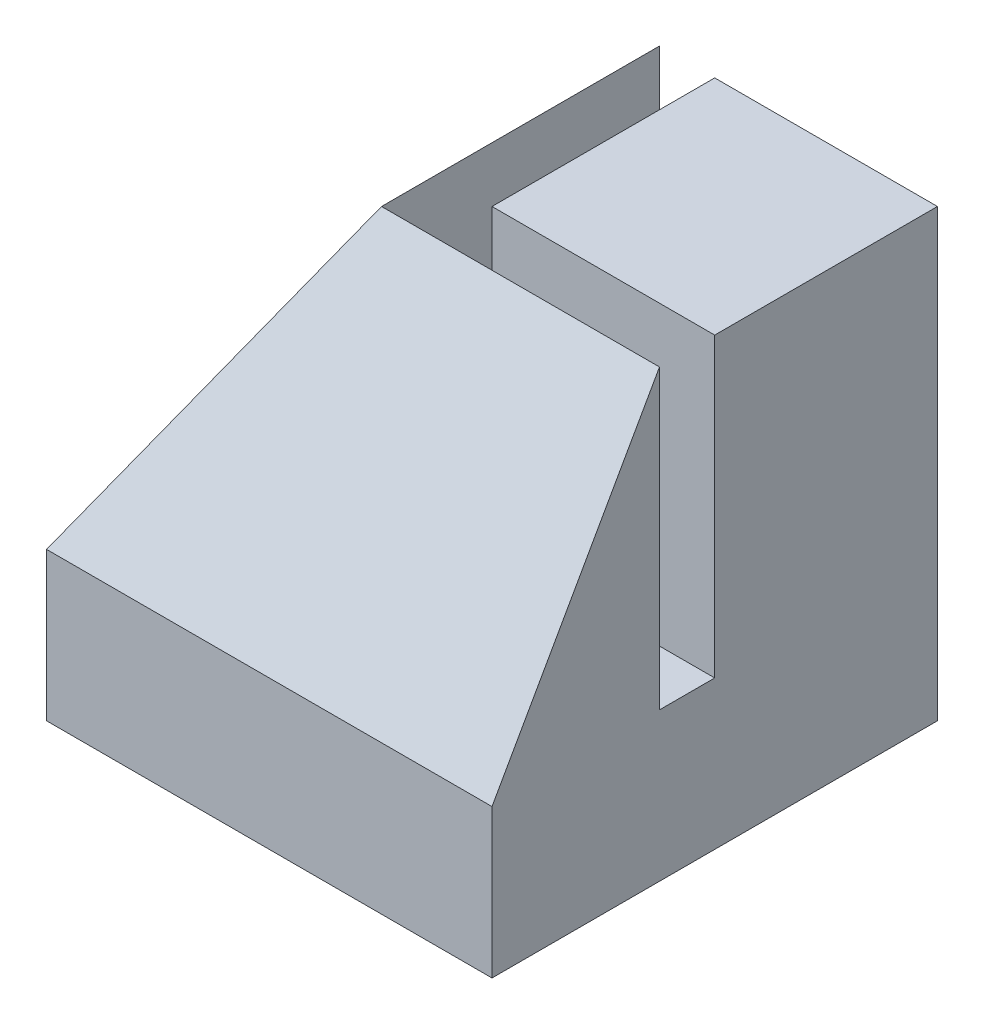
ISO-10303-21;
HEADER;
FILE_DESCRIPTION(('STEP AP214'),'2;1');
FILE_NAME('part.step','',(''),(''),'','','');
FILE_SCHEMA(('AUTOMOTIVE_DESIGN { 1 0 10303 214 1 1 1 1 }'));
ENDSEC;
DATA;
#1=APPLICATION_CONTEXT('core data for automotive mechanical design processes');
#2=APPLICATION_PROTOCOL_DEFINITION('international standard','automotive_design',2000,#1);
#3=PRODUCT_CONTEXT('',#1,'mechanical');
#4=PRODUCT('Part','Part','',(#3));
#5=PRODUCT_RELATED_PRODUCT_CATEGORY('part','',(#4));
#6=PRODUCT_DEFINITION_FORMATION('','',#4);
#7=PRODUCT_DEFINITION_CONTEXT('part definition',#1,'design');
#8=PRODUCT_DEFINITION('design','',#6,#7);
#9=PRODUCT_DEFINITION_SHAPE('','',#8);
#10=(LENGTH_UNIT() NAMED_UNIT(*) SI_UNIT(.MILLI.,.METRE.));
#11=(NAMED_UNIT(*) PLANE_ANGLE_UNIT() SI_UNIT($,.RADIAN.));
#12=(NAMED_UNIT(*) SI_UNIT($,.STERADIAN.) SOLID_ANGLE_UNIT());
#13=UNCERTAINTY_MEASURE_WITH_UNIT(LENGTH_MEASURE(1.E-05),#10,'distance_accuracy_value','');
#14=(GEOMETRIC_REPRESENTATION_CONTEXT(3) GLOBAL_UNCERTAINTY_ASSIGNED_CONTEXT((#13)) GLOBAL_UNIT_ASSIGNED_CONTEXT((#10,
#11,#12)) REPRESENTATION_CONTEXT('',''));
#15=CARTESIAN_POINT('',(0.,0.,0.));
#16=DIRECTION('',(0.,0.,1.));
#17=DIRECTION('',(1.,0.,0.));
#18=AXIS2_PLACEMENT_3D('',#15,#16,#17);
#19=CARTESIAN_POINT('',(0.,19.05,0.));
#20=DIRECTION('',(0.,-1.,0.));
#21=DIRECTION('',(0.,0.,-1.));
#22=AXIS2_PLACEMENT_3D('',#19,#20,#21);
#23=PLANE('',#22);
#24=DIRECTION('',(-1.,0.,0.));
#25=VECTOR('',#24,1.);
#26=CARTESIAN_POINT('',(-9.525,19.05,-9.525));
#27=LINE('',#26,#25);
#28=CARTESIAN_POINT('',(9.525,19.05,-9.525));
#29=VERTEX_POINT('',#28);
#30=CARTESIAN_POINT('',(0.,19.05,-9.525));
#31=VERTEX_POINT('',#30);
#32=EDGE_CURVE('E97',#29,#31,#27,.T.);
#33=ORIENTED_EDGE('',*,*,#32,.T.);
#34=DIRECTION('',(0.,0.,-1.));
#35=VECTOR('',#34,1.);
#36=CARTESIAN_POINT('',(0.,19.05,0.));
#37=LINE('',#36,#35);
#38=CARTESIAN_POINT('',(0.,19.05,0.));
#39=VERTEX_POINT('',#38);
#40=EDGE_CURVE('E130',#39,#31,#37,.T.);
#41=ORIENTED_EDGE('',*,*,#40,.F.);
#42=DIRECTION('',(-1.,0.,0.));
#43=VECTOR('',#42,1.);
#44=CARTESIAN_POINT('',(9.525,19.05,0.));
#45=LINE('',#44,#43);
#46=CARTESIAN_POINT('',(9.525,19.05,0.));
#47=VERTEX_POINT('',#46);
#48=EDGE_CURVE('E134',#47,#39,#45,.T.);
#49=ORIENTED_EDGE('',*,*,#48,.F.);
#50=DIRECTION('',(0.,0.,-1.));
#51=VECTOR('',#50,1.);
#52=CARTESIAN_POINT('',(9.525,19.05,9.525));
#53=LINE('',#52,#51);
#54=EDGE_CURVE('E50',#47,#29,#53,.T.);
#55=ORIENTED_EDGE('',*,*,#54,.T.);
#56=EDGE_LOOP('',(#33,#41,#49,#55));
#57=FACE_BOUND('',#56,.T.);
#58=ADVANCED_FACE('F34',(#57),#23,.F.);
#59=CARTESIAN_POINT('',(9.525,19.05,9.525));
#60=DIRECTION('',(-1.,0.,0.));
#61=DIRECTION('',(0.,0.,1.));
#62=AXIS2_PLACEMENT_3D('',#59,#60,#61);
#63=PLANE('',#62);
#64=DIRECTION('',(0.,1.,0.));
#65=VECTOR('',#64,1.);
#66=CARTESIAN_POINT('',(9.525,6.35,2.3622));
#67=LINE('',#66,#65);
#68=CARTESIAN_POINT('',(9.525,6.35,2.3622));
#69=VERTEX_POINT('',#68);
#70=CARTESIAN_POINT('',(9.525,19.05,2.3622));
#71=VERTEX_POINT('',#70);
#72=EDGE_CURVE('E123',#69,#71,#67,.T.);
#73=ORIENTED_EDGE('',*,*,#72,.T.);
#74=DIRECTION('',(0.,0.871016694268023,-0.491253415567165));
#75=VECTOR('',#74,1.);
#76=CARTESIAN_POINT('',(9.525,19.05,2.3622));
#77=LINE('',#76,#75);
#78=CARTESIAN_POINT('',(9.525,6.35,9.525));
#79=VERTEX_POINT('',#78);
#80=EDGE_CURVE('E165',#79,#71,#77,.T.);
#81=ORIENTED_EDGE('',*,*,#80,.F.);
#82=DIRECTION('',(0.,-1.,0.));
#83=VECTOR('',#82,1.);
#84=CARTESIAN_POINT('',(9.525,19.05,9.525));
#85=LINE('',#84,#83);
#86=CARTESIAN_POINT('',(9.525,0.,9.525));
#87=VERTEX_POINT('',#86);
#88=EDGE_CURVE('E83',#79,#87,#85,.T.);
#89=ORIENTED_EDGE('',*,*,#88,.T.);
#90=DIRECTION('',(0.,0.,-1.));
#91=VECTOR('',#90,1.);
#92=CARTESIAN_POINT('',(9.525,0.,9.525));
#93=LINE('',#92,#91);
#94=CARTESIAN_POINT('',(9.525,0.,-9.525));
#95=VERTEX_POINT('',#94);
#96=EDGE_CURVE('E95',#87,#95,#93,.T.);
#97=ORIENTED_EDGE('',*,*,#96,.T.);
#98=DIRECTION('',(0.,-1.,0.));
#99=VECTOR('',#98,1.);
#100=CARTESIAN_POINT('',(9.525,19.05,-9.525));
#101=LINE('',#100,#99);
#102=EDGE_CURVE('E43',#29,#95,#101,.T.);
#103=ORIENTED_EDGE('',*,*,#102,.F.);
#104=ORIENTED_EDGE('',*,*,#54,.F.);
#105=DIRECTION('',(0.,1.,0.));
#106=VECTOR('',#105,1.);
#107=CARTESIAN_POINT('',(9.525,6.35,0.));
#108=LINE('',#107,#106);
#109=CARTESIAN_POINT('',(9.525,6.35,0.));
#110=VERTEX_POINT('',#109);
#111=EDGE_CURVE('E125',#110,#47,#108,.T.);
#112=ORIENTED_EDGE('',*,*,#111,.F.);
#113=DIRECTION('',(0.,0.,-1.));
#114=VECTOR('',#113,1.);
#115=CARTESIAN_POINT('',(9.525,6.35,2.3622));
#116=LINE('',#115,#114);
#117=EDGE_CURVE('E149',#69,#110,#116,.T.);
#118=ORIENTED_EDGE('',*,*,#117,.F.);
#119=EDGE_LOOP('',(#73,#81,#89,#97,#103,#104,#112,#118));
#120=FACE_BOUND('',#119,.T.);
#121=ADVANCED_FACE('F36',(#120),#63,.F.);
#122=CARTESIAN_POINT('',(-9.525,19.05,-9.525));
#123=DIRECTION('',(0.,0.,1.));
#124=DIRECTION('',(1.,0.,0.));
#125=AXIS2_PLACEMENT_3D('',#122,#123,#124);
#126=PLANE('',#125);
#127=DIRECTION('',(0.,-1.,0.));
#128=VECTOR('',#127,1.);
#129=CARTESIAN_POINT('',(-9.525,19.05,-9.525));
#130=LINE('',#129,#128);
#131=CARTESIAN_POINT('',(-9.525,6.35,-9.525));
#132=VERTEX_POINT('',#131);
#133=CARTESIAN_POINT('',(-9.525,0.,-9.525));
#134=VERTEX_POINT('',#133);
#135=EDGE_CURVE('E82',#132,#134,#130,.T.);
#136=ORIENTED_EDGE('',*,*,#135,.F.);
#137=DIRECTION('',(0.491253415567165,0.871016694268023,0.));
#138=VECTOR('',#137,1.);
#139=CARTESIAN_POINT('',(-9.525,6.35,-9.525));
#140=LINE('',#139,#138);
#141=CARTESIAN_POINT('',(-2.3622,19.05,-9.525));
#142=VERTEX_POINT('',#141);
#143=EDGE_CURVE('E161',#132,#142,#140,.T.);
#144=ORIENTED_EDGE('',*,*,#143,.T.);
#145=DIRECTION('',(0.,1.,0.));
#146=VECTOR('',#145,1.);
#147=CARTESIAN_POINT('',(-2.3622,6.35,-9.525));
#148=LINE('',#147,#146);
#149=CARTESIAN_POINT('',(-2.3622,6.35,-9.525));
#150=VERTEX_POINT('',#149);
#151=EDGE_CURVE('E116',#150,#142,#148,.T.);
#152=ORIENTED_EDGE('',*,*,#151,.F.);
#153=DIRECTION('',(-1.,0.,0.));
#154=VECTOR('',#153,1.);
#155=CARTESIAN_POINT('',(0.,6.35,-9.525));
#156=LINE('',#155,#154);
#157=CARTESIAN_POINT('',(0.,6.35,-9.525));
#158=VERTEX_POINT('',#157);
#159=EDGE_CURVE('E133',#158,#150,#156,.T.);
#160=ORIENTED_EDGE('',*,*,#159,.F.);
#161=DIRECTION('',(0.,1.,0.));
#162=VECTOR('',#161,1.);
#163=CARTESIAN_POINT('',(0.,6.35,-9.525));
#164=LINE('',#163,#162);
#165=EDGE_CURVE('E110',#158,#31,#164,.T.);
#166=ORIENTED_EDGE('',*,*,#165,.T.);
#167=ORIENTED_EDGE('',*,*,#32,.F.);
#168=ORIENTED_EDGE('',*,*,#102,.T.);
#169=DIRECTION('',(-1.,0.,0.));
#170=VECTOR('',#169,1.);
#171=CARTESIAN_POINT('',(-9.525,0.,-9.525));
#172=LINE('',#171,#170);
#173=EDGE_CURVE('E91',#95,#134,#172,.T.);
#174=ORIENTED_EDGE('',*,*,#173,.T.);
#175=EDGE_LOOP('',(#136,#144,#152,#160,#166,#167,#168,#174));
#176=FACE_BOUND('',#175,.T.);
#177=ADVANCED_FACE('F105',(#176),#126,.F.);
#178=CARTESIAN_POINT('',(-9.525,19.05,9.525));
#179=DIRECTION('',(1.,0.,0.));
#180=DIRECTION('',(0.,0.,-1.));
#181=AXIS2_PLACEMENT_3D('',#178,#179,#180);
#182=PLANE('',#181);
#183=DIRECTION('',(0.,-1.,0.));
#184=VECTOR('',#183,1.);
#185=CARTESIAN_POINT('',(-9.525,19.05,9.525));
#186=LINE('',#185,#184);
#187=CARTESIAN_POINT('',(-9.525,6.35,9.525));
#188=VERTEX_POINT('',#187);
#189=CARTESIAN_POINT('',(-9.525,0.,9.525));
#190=VERTEX_POINT('',#189);
#191=EDGE_CURVE('E69',#188,#190,#186,.T.);
#192=ORIENTED_EDGE('',*,*,#191,.F.);
#193=DIRECTION('',(0.,0.,1.));
#194=VECTOR('',#193,1.);
#195=CARTESIAN_POINT('',(-9.525,6.35,-9.525));
#196=LINE('',#195,#194);
#197=EDGE_CURVE('E143',#132,#188,#196,.T.);
#198=ORIENTED_EDGE('',*,*,#197,.F.);
#199=ORIENTED_EDGE('',*,*,#135,.T.);
#200=DIRECTION('',(0.,0.,1.));
#201=VECTOR('',#200,1.);
#202=CARTESIAN_POINT('',(-9.525,0.,9.525));
#203=LINE('',#202,#201);
#204=EDGE_CURVE('E86',#134,#190,#203,.T.);
#205=ORIENTED_EDGE('',*,*,#204,.T.);
#206=EDGE_LOOP('',(#192,#198,#199,#205));
#207=FACE_BOUND('',#206,.T.);
#208=ADVANCED_FACE('F87',(#207),#182,.F.);
#209=CARTESIAN_POINT('',(-9.525,19.05,9.525));
#210=DIRECTION('',(0.,0.,-1.));
#211=DIRECTION('',(-1.,0.,0.));
#212=AXIS2_PLACEMENT_3D('',#209,#210,#211);
#213=PLANE('',#212);
#214=ORIENTED_EDGE('',*,*,#88,.F.);
#215=DIRECTION('',(1.,0.,0.));
#216=VECTOR('',#215,1.);
#217=CARTESIAN_POINT('',(-9.525,6.35,9.525));
#218=LINE('',#217,#216);
#219=EDGE_CURVE('E78',#188,#79,#218,.T.);
#220=ORIENTED_EDGE('',*,*,#219,.F.);
#221=ORIENTED_EDGE('',*,*,#191,.T.);
#222=DIRECTION('',(1.,0.,0.));
#223=VECTOR('',#222,1.);
#224=CARTESIAN_POINT('',(-9.525,0.,9.525));
#225=LINE('',#224,#223);
#226=EDGE_CURVE('E74',#190,#87,#225,.T.);
#227=ORIENTED_EDGE('',*,*,#226,.T.);
#228=EDGE_LOOP('',(#214,#220,#221,#227));
#229=FACE_BOUND('',#228,.T.);
#230=ADVANCED_FACE('F72',(#229),#213,.F.);
#231=CARTESIAN_POINT('',(0.,0.,0.));
#232=DIRECTION('',(0.,-1.,0.));
#233=DIRECTION('',(0.,0.,-1.));
#234=AXIS2_PLACEMENT_3D('',#231,#232,#233);
#235=PLANE('',#234);
#236=ORIENTED_EDGE('',*,*,#96,.F.);
#237=ORIENTED_EDGE('',*,*,#226,.F.);
#238=ORIENTED_EDGE('',*,*,#204,.F.);
#239=ORIENTED_EDGE('',*,*,#173,.F.);
#240=EDGE_LOOP('',(#236,#237,#238,#239));
#241=FACE_BOUND('',#240,.T.);
#242=ADVANCED_FACE('F93',(#241),#235,.T.);
#243=CARTESIAN_POINT('',(0.,6.35,0.));
#244=DIRECTION('',(1.,0.,0.));
#245=DIRECTION('',(0.,0.,-1.));
#246=AXIS2_PLACEMENT_3D('',#243,#244,#245);
#247=PLANE('',#246);
#248=ORIENTED_EDGE('',*,*,#40,.T.);
#249=ORIENTED_EDGE('',*,*,#165,.F.);
#250=DIRECTION('',(0.,0.,-1.));
#251=VECTOR('',#250,1.);
#252=CARTESIAN_POINT('',(0.,6.35,0.));
#253=LINE('',#252,#251);
#254=CARTESIAN_POINT('',(0.,6.35,0.));
#255=VERTEX_POINT('',#254);
#256=EDGE_CURVE('E120',#255,#158,#253,.T.);
#257=ORIENTED_EDGE('',*,*,#256,.F.);
#258=DIRECTION('',(0.,1.,0.));
#259=VECTOR('',#258,1.);
#260=CARTESIAN_POINT('',(0.,6.35,0.));
#261=LINE('',#260,#259);
#262=EDGE_CURVE('E112',#255,#39,#261,.T.);
#263=ORIENTED_EDGE('',*,*,#262,.T.);
#264=EDGE_LOOP('',(#248,#249,#257,#263));
#265=FACE_BOUND('',#264,.T.);
#266=ADVANCED_FACE('F223',(#265),#247,.F.);
#267=CARTESIAN_POINT('',(9.525,6.35,0.));
#268=DIRECTION('',(0.,0.,-1.));
#269=DIRECTION('',(-1.,0.,0.));
#270=AXIS2_PLACEMENT_3D('',#267,#268,#269);
#271=PLANE('',#270);
#272=ORIENTED_EDGE('',*,*,#48,.T.);
#273=ORIENTED_EDGE('',*,*,#262,.F.);
#274=DIRECTION('',(-1.,0.,0.));
#275=VECTOR('',#274,1.);
#276=CARTESIAN_POINT('',(9.525,6.35,0.));
#277=LINE('',#276,#275);
#278=EDGE_CURVE('E146',#110,#255,#277,.T.);
#279=ORIENTED_EDGE('',*,*,#278,.F.);
#280=ORIENTED_EDGE('',*,*,#111,.T.);
#281=EDGE_LOOP('',(#272,#273,#279,#280));
#282=FACE_BOUND('',#281,.T.);
#283=ADVANCED_FACE('F221',(#282),#271,.F.);
#284=CARTESIAN_POINT('',(-2.3622,6.35,2.3622));
#285=DIRECTION('',(0.,0.,1.));
#286=DIRECTION('',(1.,0.,0.));
#287=AXIS2_PLACEMENT_3D('',#284,#285,#286);
#288=PLANE('',#287);
#289=DIRECTION('',(1.,0.,0.));
#290=VECTOR('',#289,1.);
#291=CARTESIAN_POINT('',(-2.3622,19.05,2.3622));
#292=LINE('',#291,#290);
#293=CARTESIAN_POINT('',(-2.3622,19.05,2.3622));
#294=VERTEX_POINT('',#293);
#295=EDGE_CURVE('E137',#294,#71,#292,.T.);
#296=ORIENTED_EDGE('',*,*,#295,.T.);
#297=ORIENTED_EDGE('',*,*,#72,.F.);
#298=DIRECTION('',(1.,0.,0.));
#299=VECTOR('',#298,1.);
#300=CARTESIAN_POINT('',(-2.3622,6.35,2.3622));
#301=LINE('',#300,#299);
#302=CARTESIAN_POINT('',(-2.3622,6.35,2.3622));
#303=VERTEX_POINT('',#302);
#304=EDGE_CURVE('E152',#303,#69,#301,.T.);
#305=ORIENTED_EDGE('',*,*,#304,.F.);
#306=DIRECTION('',(0.,1.,0.));
#307=VECTOR('',#306,1.);
#308=CARTESIAN_POINT('',(-2.3622,6.35,2.3622));
#309=LINE('',#308,#307);
#310=EDGE_CURVE('E119',#303,#294,#309,.T.);
#311=ORIENTED_EDGE('',*,*,#310,.T.);
#312=EDGE_LOOP('',(#296,#297,#305,#311));
#313=FACE_BOUND('',#312,.T.);
#314=ADVANCED_FACE('F177',(#313),#288,.F.);
#315=CARTESIAN_POINT('',(-2.3622,6.35,-9.525));
#316=DIRECTION('',(-1.,0.,0.));
#317=DIRECTION('',(0.,0.,1.));
#318=AXIS2_PLACEMENT_3D('',#315,#316,#317);
#319=PLANE('',#318);
#320=DIRECTION('',(0.,0.,1.));
#321=VECTOR('',#320,1.);
#322=CARTESIAN_POINT('',(-2.3622,19.05,-9.525));
#323=LINE('',#322,#321);
#324=EDGE_CURVE('E140',#142,#294,#323,.T.);
#325=ORIENTED_EDGE('',*,*,#324,.T.);
#326=ORIENTED_EDGE('',*,*,#310,.F.);
#327=DIRECTION('',(0.,0.,1.));
#328=VECTOR('',#327,1.);
#329=CARTESIAN_POINT('',(-2.3622,6.35,-9.525));
#330=LINE('',#329,#328);
#331=EDGE_CURVE('E155',#150,#303,#330,.T.);
#332=ORIENTED_EDGE('',*,*,#331,.F.);
#333=ORIENTED_EDGE('',*,*,#151,.T.);
#334=EDGE_LOOP('',(#325,#326,#332,#333));
#335=FACE_BOUND('',#334,.T.);
#336=ADVANCED_FACE('F220',(#335),#319,.F.);
#337=CARTESIAN_POINT('',(0.,6.35,0.));
#338=DIRECTION('',(0.,1.,0.));
#339=DIRECTION('',(0.,0.,1.));
#340=AXIS2_PLACEMENT_3D('',#337,#338,#339);
#341=PLANE('',#340);
#342=ORIENTED_EDGE('',*,*,#159,.T.);
#343=ORIENTED_EDGE('',*,*,#331,.T.);
#344=ORIENTED_EDGE('',*,*,#304,.T.);
#345=ORIENTED_EDGE('',*,*,#117,.T.);
#346=ORIENTED_EDGE('',*,*,#278,.T.);
#347=ORIENTED_EDGE('',*,*,#256,.T.);
#348=EDGE_LOOP('',(#342,#343,#344,#345,#346,#347));
#349=FACE_BOUND('',#348,.T.);
#350=ADVANCED_FACE('F187',(#349),#341,.T.);
#351=CARTESIAN_POINT('',(-9.525,6.35,-9.525));
#352=DIRECTION('',(0.871016694268023,-0.491253415567165,0.));
#353=DIRECTION('',(0.491253415567165,0.871016694268023,0.));
#354=AXIS2_PLACEMENT_3D('',#351,#352,#353);
#355=PLANE('',#354);
#356=ORIENTED_EDGE('',*,*,#197,.T.);
#357=DIRECTION('',(0.440922205949929,0.781776960904129,-0.440922205949929));
#358=VECTOR('',#357,1.);
#359=CARTESIAN_POINT('',(-5.82144393811973,12.9165887621991,5.82144393811973));
#360=LINE('',#359,#358);
#361=EDGE_CURVE('E11',#188,#294,#360,.T.);
#362=ORIENTED_EDGE('',*,*,#361,.T.);
#363=ORIENTED_EDGE('',*,*,#324,.F.);
#364=ORIENTED_EDGE('',*,*,#143,.F.);
#365=EDGE_LOOP('',(#356,#362,#363,#364));
#366=FACE_BOUND('',#365,.T.);
#367=ADVANCED_FACE('F217',(#366),#355,.F.);
#368=CARTESIAN_POINT('',(-9.525,19.05,2.3622));
#369=DIRECTION('',(0.,-0.491253415567165,-0.871016694268023));
#370=DIRECTION('',(0.,0.871016694268023,-0.491253415567165));
#371=AXIS2_PLACEMENT_3D('',#368,#369,#370);
#372=PLANE('',#371);
#373=ORIENTED_EDGE('',*,*,#219,.T.);
#374=ORIENTED_EDGE('',*,*,#80,.T.);
#375=ORIENTED_EDGE('',*,*,#295,.F.);
#376=ORIENTED_EDGE('',*,*,#361,.F.);
#377=EDGE_LOOP('',(#373,#374,#375,#376));
#378=FACE_BOUND('',#377,.T.);
#379=ADVANCED_FACE('F170',(#378),#372,.F.);
#380=CLOSED_SHELL('',(#58,#121,#177,#208,#230,#242,#266,#283,#314,#336,#350,#367,#379));
#381=MANIFOLD_SOLID_BREP('B2',#380);
#382=ADVANCED_BREP_SHAPE_REPRESENTATION('',(#18,#381),#14);
#383=SHAPE_DEFINITION_REPRESENTATION(#9,#382);
ENDSEC;
END-ISO-10303-21;
